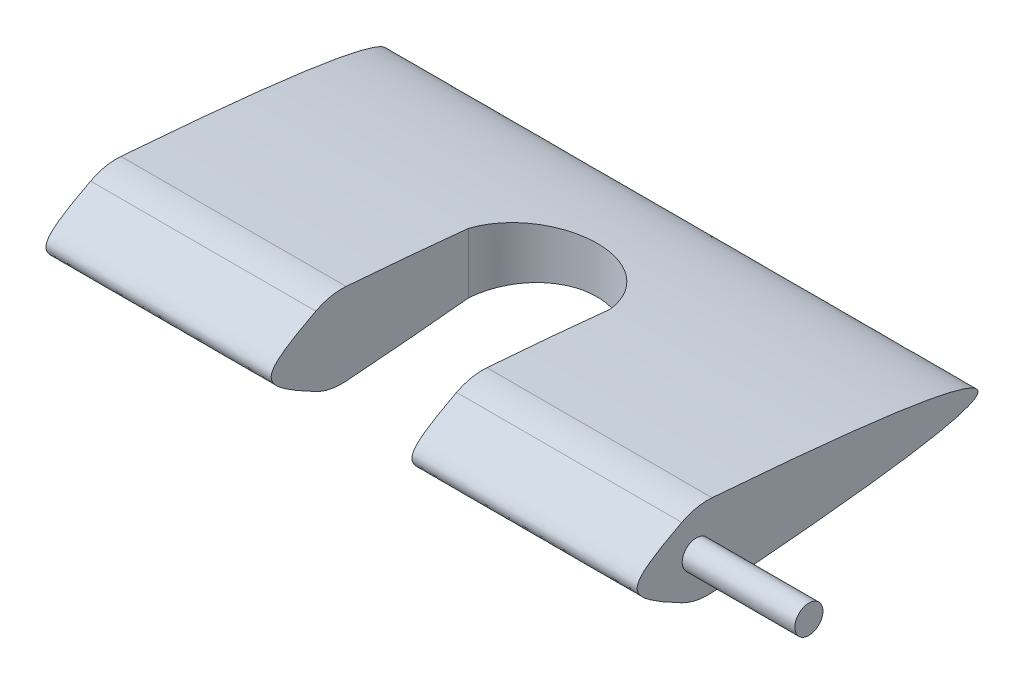
ISO-10303-21;
HEADER;
FILE_DESCRIPTION(('STEP AP214'),'2;1');
FILE_NAME('part.step','',(''),(''),'','','');
FILE_SCHEMA(('AUTOMOTIVE_DESIGN { 1 0 10303 214 1 1 1 1 }'));
ENDSEC;
DATA;
#1=APPLICATION_CONTEXT('core data for automotive mechanical design processes');
#2=APPLICATION_PROTOCOL_DEFINITION('international standard','automotive_design',2000,#1);
#3=PRODUCT_CONTEXT('',#1,'mechanical');
#4=PRODUCT('Part','Part','',(#3));
#5=PRODUCT_RELATED_PRODUCT_CATEGORY('part','',(#4));
#6=PRODUCT_DEFINITION_FORMATION('','',#4);
#7=PRODUCT_DEFINITION_CONTEXT('part definition',#1,'design');
#8=PRODUCT_DEFINITION('design','',#6,#7);
#9=PRODUCT_DEFINITION_SHAPE('','',#8);
#10=(LENGTH_UNIT() NAMED_UNIT(*) SI_UNIT(.MILLI.,.METRE.));
#11=(NAMED_UNIT(*) PLANE_ANGLE_UNIT() SI_UNIT($,.RADIAN.));
#12=(NAMED_UNIT(*) SI_UNIT($,.STERADIAN.) SOLID_ANGLE_UNIT());
#13=UNCERTAINTY_MEASURE_WITH_UNIT(LENGTH_MEASURE(1.E-05),#10,'distance_accuracy_value','');
#14=(GEOMETRIC_REPRESENTATION_CONTEXT(3) GLOBAL_UNCERTAINTY_ASSIGNED_CONTEXT((#13)) GLOBAL_UNIT_ASSIGNED_CONTEXT((#10,
#11,#12)) REPRESENTATION_CONTEXT('',''));
#15=CARTESIAN_POINT('',(0.,0.,0.));
#16=DIRECTION('',(0.,0.,1.));
#17=DIRECTION('',(1.,0.,0.));
#18=AXIS2_PLACEMENT_3D('',#15,#16,#17);
#19=CARTESIAN_POINT('',(0.,0.,0.));
#20=DIRECTION('',(1.,0.,0.));
#21=DIRECTION('',(0.,0.,-1.));
#22=AXIS2_PLACEMENT_3D('',#19,#20,#21);
#23=PLANE('',#22);
#24=CARTESIAN_POINT('',(0.,7.5,-3.7289748644447E-07));
#25=CARTESIAN_POINT('',(0.,0.,15.));
#26=CARTESIAN_POINT('',(0.,-7.5,3.72897486269191E-07));
#27=(BOUNDED_CURVE() B_SPLINE_CURVE(2,(#24,#25,#26),.UNSPECIFIED.,.F.,
.F.) B_SPLINE_CURVE_WITH_KNOTS((3,3),(0.,1.),
.UNSPECIFIED.) CURVE() GEOMETRIC_REPRESENTATION_ITEM() RATIONAL_B_SPLINE_CURVE((1.,
2.33333333333333,1.)) REPRESENTATION_ITEM(''));
#28=CARTESIAN_POINT('',(0.,6.18387436862828,2.58281473243405));
#29=VERTEX_POINT('',#28);
#30=CARTESIAN_POINT('',(0.,-6.18387425438638,2.58281556655406));
#31=VERTEX_POINT('',#30);
#32=EDGE_CURVE('E246',#29,#31,#27,.T.);
#33=ORIENTED_EDGE('',*,*,#32,.F.);
#34=CARTESIAN_POINT('',(0.,-2.68401655188481,-2.03892851247706));
#35=DIRECTION('',(1.,0.,0.));
#36=DIRECTION('',(0.,0.,-1.));
#37=AXIS2_PLACEMENT_3D('',#34,#35,#36);
#38=CIRCLE('',#37,10.);
#39=CARTESIAN_POINT('',(0.,7.28632207451857,-2.80856977621536));
#40=VERTEX_POINT('',#39);
#41=EDGE_CURVE('E474',#29,#40,#38,.F.);
#42=ORIENTED_EDGE('',*,*,#41,.T.);
#43=CARTESIAN_POINT('',(0.,7.5,-3.7289748644447E-07));
#44=CARTESIAN_POINT('',(0.,0.,-100.));
#45=CARTESIAN_POINT('',(0.,-7.5,3.72897486269191E-07));
#46=(BOUNDED_CURVE() B_SPLINE_CURVE(2,(#43,#44,#45),.UNSPECIFIED.,.F.,
.F.) B_SPLINE_CURVE_WITH_KNOTS((3,3),(0.,1.),
.UNSPECIFIED.) CURVE() GEOMETRIC_REPRESENTATION_ITEM() RATIONAL_B_SPLINE_CURVE((1.,
1.0014677651621,1.)) REPRESENTATION_ITEM(''));
#47=CARTESIAN_POINT('',(0.,-7.28632206754482,-2.80856914201004));
#48=VERTEX_POINT('',#47);
#49=EDGE_CURVE('E514',#40,#48,#46,.T.);
#50=ORIENTED_EDGE('',*,*,#49,.T.);
#51=CARTESIAN_POINT('',(0.,2.68401655925553,-2.03892788341429));
#52=DIRECTION('',(1.,0.,0.));
#53=DIRECTION('',(0.,0.,-1.));
#54=AXIS2_PLACEMENT_3D('',#51,#52,#53);
#55=CIRCLE('',#54,10.);
#56=EDGE_CURVE('E478',#48,#31,#55,.F.);
#57=ORIENTED_EDGE('',*,*,#56,.T.);
#58=EDGE_LOOP('',(#33,#42,#50,#57));
#59=FACE_BOUND('',#58,.T.);
#60=CARTESIAN_POINT('',(0.,2.22044604925031E-13,-13.7499999999998));
#61=DIRECTION('',(1.,0.,0.));
#62=DIRECTION('',(0.,0.,-1.));
#63=AXIS2_PLACEMENT_3D('',#60,#61,#62);
#64=CIRCLE('',#63,2.);
#65=CARTESIAN_POINT('',(0.,2.00000000000022,-13.7499999999998));
#66=VERTEX_POINT('',#65);
#67=CARTESIAN_POINT('',(0.,-1.99999999999978,-13.7499999999998));
#68=VERTEX_POINT('',#67);
#69=EDGE_CURVE('E68',#66,#68,#64,.F.);
#70=ORIENTED_EDGE('',*,*,#69,.F.);
#71=DIRECTION('',(0.,0.04540766091865,0.9989685402103));
#72=VECTOR('',#71,1.);
#73=CARTESIAN_POINT('',(0.,2.61958762886619,-0.119072164948463));
#74=LINE('',#73,#72);
#75=CARTESIAN_POINT('',(0.,2.49786390523226,-2.79699408489502));
#76=VERTEX_POINT('',#75);
#77=EDGE_CURVE('E12',#66,#76,#74,.T.);
#78=ORIENTED_EDGE('',*,*,#77,.T.);
#79=CARTESIAN_POINT('',(0.,2.22044604925031E-13,2.22044604925031E-13));
#80=DIRECTION('',(1.,0.,0.));
#81=DIRECTION('',(0.,0.,-1.));
#82=AXIS2_PLACEMENT_3D('',#79,#80,#81);
#83=CIRCLE('',#82,3.75);
#84=CARTESIAN_POINT('',(0.,-2.49786390523181,-2.79699408489502));
#85=VERTEX_POINT('',#84);
#86=EDGE_CURVE('E280',#85,#76,#83,.F.);
#87=ORIENTED_EDGE('',*,*,#86,.F.);
#88=DIRECTION('',(0.,-0.04540766091865,0.9989685402103));
#89=VECTOR('',#88,1.);
#90=CARTESIAN_POINT('',(0.,-2.61958762886575,-0.119072164948443));
#91=LINE('',#90,#89);
#92=EDGE_CURVE('E311',#68,#85,#91,.T.);
#93=ORIENTED_EDGE('',*,*,#92,.F.);
#94=EDGE_LOOP('',(#70,#78,#87,#93));
#95=FACE_BOUND('',#94,.T.);
#96=ADVANCED_FACE('F60',(#59,#95),#23,.F.);
#97=CARTESIAN_POINT('',(105.,7.5,-3.7289748644447E-07));
#98=CARTESIAN_POINT('',(105.,0.,-100.));
#99=CARTESIAN_POINT('',(105.,-7.5,3.72897486269191E-07));
#100=(BOUNDED_CURVE() B_SPLINE_CURVE(2,(#97,#98,#99),.UNSPECIFIED.,.F.,
.F.) B_SPLINE_CURVE_WITH_KNOTS((3,3),(0.,1.),
.UNSPECIFIED.) CURVE() GEOMETRIC_REPRESENTATION_ITEM() RATIONAL_B_SPLINE_CURVE((1.,
1.0014677651621,1.)) REPRESENTATION_ITEM(''));
#101=DIRECTION('',(-1.,0.,0.));
#102=VECTOR('',#101,1.);
#103=SURFACE_OF_LINEAR_EXTRUSION('',#100,#102);
#104=DIRECTION('',(-1.,0.,0.));
#105=VECTOR('',#104,1.);
#106=CARTESIAN_POINT('',(0.,7.28632207451857,-2.80856977621536));
#107=LINE('',#106,#105);
#108=CARTESIAN_POINT('',(40.,7.28632207451858,-2.80856977621536));
#109=VERTEX_POINT('',#108);
#110=EDGE_CURVE('E490',#40,#109,#107,.F.);
#111=ORIENTED_EDGE('',*,*,#110,.T.);
#112=CARTESIAN_POINT('',(40.,7.5,-3.7289748644447E-07));
#113=CARTESIAN_POINT('',(40.,0.,-100.));
#114=CARTESIAN_POINT('',(40.,-7.5,3.72897486269191E-07));
#115=(BOUNDED_CURVE() B_SPLINE_CURVE(2,(#112,#113,#114),.UNSPECIFIED.,.F.,
.F.) B_SPLINE_CURVE_WITH_KNOTS((3,3),(0.,1.),
.UNSPECIFIED.) CURVE() GEOMETRIC_REPRESENTATION_ITEM() RATIONAL_B_SPLINE_CURVE((1.,
1.0014677651621,1.)) REPRESENTATION_ITEM(''));
#116=CARTESIAN_POINT('',(40.,5.34878506985404,-24.5781791610746));
#117=VERTEX_POINT('',#116);
#118=EDGE_CURVE('E233',#109,#117,#115,.T.);
#119=ORIENTED_EDGE('',*,*,#118,.T.);
#120=CARTESIAN_POINT('',(40.,5.34878506985404,-24.5781791610746));
#121=CARTESIAN_POINT('',(40.0678801430756,5.31169119503989,-24.9311959440567));
#122=CARTESIAN_POINT('',(40.1507834210595,5.27450928435787,-25.2813077319358));
#123=CARTESIAN_POINT('',(40.3458846524781,5.20024551705142,-25.9732683528519));
#124=CARTESIAN_POINT('',(40.4580814593022,5.1631636565682,-26.3151175087337));
#125=CARTESIAN_POINT('',(40.7109561728681,5.08939283487344,-26.9879485508752));
#126=CARTESIAN_POINT('',(40.8516188667802,5.05270367477459,-27.3189361324685));
#127=CARTESIAN_POINT('',(41.1604647240169,4.97999378594866,-27.9678834618567));
#128=CARTESIAN_POINT('',(41.3286475184933,4.94397304827002,-28.2858433841881));
#129=CARTESIAN_POINT('',(41.6914585546635,4.87289069360894,-28.906636739573));
#130=CARTESIAN_POINT('',(41.8861004641603,4.83782958365442,-29.209462243441));
#131=CARTESIAN_POINT('',(42.3004028014392,4.76901077064709,-29.7976428727111));
#132=CARTESIAN_POINT('',(42.5200631447895,4.73525306319609,-30.0829980570666));
#133=CARTESIAN_POINT('',(42.9828164170752,4.66938475315652,-30.634125846401));
#134=CARTESIAN_POINT('',(43.2259041036361,4.63727378452722,-30.8999028090526));
#135=CARTESIAN_POINT('',(43.7338493222547,4.57503550283599,-31.4100204891335));
#136=CARTESIAN_POINT('',(43.9987067017558,4.54490817587584,-31.6543613567569));
#137=CARTESIAN_POINT('',(44.5476280869543,4.48705850278073,-32.1192334437331));
#138=CARTESIAN_POINT('',(44.8316413696267,4.45933021723105,-32.3398238150866));
#139=CARTESIAN_POINT('',(45.4174772793626,4.4065342711399,-32.7562940989182));
#140=CARTESIAN_POINT('',(45.7192999218937,4.38146661290925,-32.9521739899346));
#141=CARTESIAN_POINT('',(46.3386549043917,4.33431913842204,-33.3177983836322));
#142=CARTESIAN_POINT('',(46.6561891816002,4.31223969187134,-33.4875396527627));
#143=CARTESIAN_POINT('',(47.3046665049744,4.27138165455934,-33.7995900900865));
#144=CARTESIAN_POINT('',(47.6356094678933,4.25260304330896,-33.941899428557));
#145=CARTESIAN_POINT('',(48.3061043423443,4.21874666520556,-34.1970926627965));
#146=CARTESIAN_POINT('',(48.6455772303255,4.20364325576371,-34.3101808049648));
#147=CARTESIAN_POINT('',(49.3329727681321,4.17719447767935,-34.5074139628985));
#148=CARTESIAN_POINT('',(49.6808953799655,4.16584909214326,-34.5915591087724));
#149=CARTESIAN_POINT('',(50.3826567362234,4.14709721520578,-34.7302634003057));
#150=CARTESIAN_POINT('',(50.7364948690755,4.13969031919189,-34.7848255851201));
#151=CARTESIAN_POINT('',(51.4475697406401,4.12893429608891,-34.8639622238861));
#152=CARTESIAN_POINT('',(51.804806464705,4.12558515151914,-34.8885368070235));
#153=CARTESIAN_POINT('',(52.5175565886567,4.12300907507125,-34.9074441077101));
#154=CARTESIAN_POINT('',(52.8730642452712,4.1237530801485,-34.901990040803));
#155=CARTESIAN_POINT('',(53.5823454932412,4.12928373457918,-34.8613753424734));
#156=CARTESIAN_POINT('',(53.9361190937145,4.13407036265326,-34.8262148674179));
#157=CARTESIAN_POINT('',(54.6394192269773,4.14760866799747,-34.7264507226562));
#158=CARTESIAN_POINT('',(54.9889456793044,4.15636042026705,-34.6618464960278));
#159=CARTESIAN_POINT('',(55.6812638683352,4.17768964210423,-34.5036778972573));
#160=CARTESIAN_POINT('',(56.0240555960586,4.19026711677277,-34.4101134865016));
#161=CARTESIAN_POINT('',(56.7001736497202,4.21904029492765,-34.1948183773292));
#162=CARTESIAN_POINT('',(57.0335083309435,4.23523268485189,-34.0731134698848));
#163=CARTESIAN_POINT('',(57.6887030785651,4.27100229787543,-33.802386094651));
#164=CARTESIAN_POINT('',(58.0105631590982,4.290579516805,-33.6533636605136));
#165=CARTESIAN_POINT('',(58.6405506697767,4.33284124710942,-33.3290975281877));
#166=CARTESIAN_POINT('',(58.9486789852092,4.35552555778484,-33.1538555235582));
#167=CARTESIAN_POINT('',(59.549098791978,4.40369997639737,-32.7784073919167));
#168=CARTESIAN_POINT('',(59.8413902351216,4.42919009287205,-32.5782011889428));
#169=CARTESIAN_POINT('',(60.4098137756467,4.4828154174726,-32.1529968834003));
#170=CARTESIAN_POINT('',(60.6858398004738,4.51096541096192,-31.9278588402406));
#171=CARTESIAN_POINT('',(61.2179386540453,4.56944802725332,-31.4553786538623));
#172=CARTESIAN_POINT('',(61.4740112379204,4.59978067683224,-31.2080362382312));
#173=CARTESIAN_POINT('',(61.9645635420262,4.66230849316994,-30.6927801172791));
#174=CARTESIAN_POINT('',(62.1990326881943,4.69450455957967,-30.4248564546309));
#175=CARTESIAN_POINT('',(62.644626269206,4.76041348638287,-29.8704435243608));
#176=CARTESIAN_POINT('',(62.8557514376787,4.79412629906281,-29.5839548406293));
#177=CARTESIAN_POINT('',(63.2549003714923,4.86303653255641,-28.9919290829514));
#178=CARTESIAN_POINT('',(63.4427145994851,4.89824406556296,-28.6862519029525));
#179=CARTESIAN_POINT('',(63.7918442991666,4.96955676797845,-28.060220739217));
#180=CARTESIAN_POINT('',(63.9531598962021,5.00566193314038,-27.7398668249151));
#181=CARTESIAN_POINT('',(64.2479237233511,5.07840367210901,-27.0873106856622));
#182=CARTESIAN_POINT('',(64.3814180024938,5.11503925871381,-26.7551291221159));
#183=CARTESIAN_POINT('',(64.619897347441,5.18860017405163,-26.0808757302997));
#184=CARTESIAN_POINT('',(64.724898868413,5.22552532282322,-25.7388097373483));
#185=CARTESIAN_POINT('',(64.8505569817135,5.27685988103877,-25.2581948459556));
#186=CARTESIAN_POINT('',(64.8835919704051,5.29126355742293,-25.1227878890582));
#187=CARTESIAN_POINT('',(64.9451602845925,5.3200434159117,-24.8511288787441));
#188=CARTESIAN_POINT('',(64.9736991106537,5.33441961001858,-24.7148780732525));
#189=CARTESIAN_POINT('',(65.,5.34878506985404,-24.5781791610746));
#190=B_SPLINE_CURVE_WITH_KNOTS('',3,(#120,#121,#122,#123,#124,#125,#126,#127,#128,#129,#130,
#131,#132,#133,#134,#135,#136,#137,#138,#139,#140,#141,#142,#143,#144,#145,#146,#147,#148,#149,
#150,#151,#152,#153,#154,#155,#156,#157,#158,#159,#160,#161,#162,#163,#164,#165,#166,#167,#168,
#169,#170,#171,#172,#173,#174,#175,#176,#177,#178,#179,#180,#181,#182,#183,#184,#185,#186,#187,
#188,#189),.UNSPECIFIED.,.F.,.F.,(4,2,2,2,2,2,2,2,2,2,2,2,2,2,2,2,2,2,2,2,2,2,2,2,2,2,2,2,2,2,2,
2,2,2,4),(0.,1.08384787819964,2.16765333866133,3.25088111074634,4.33409436566854,
5.41786931009625,6.50164059712652,7.58516992752824,8.6686916654712,9.74944916365871,
10.830207600501,11.9110996283412,12.9919849465831,14.0650973450975,15.1382049195438,
16.2112022292156,17.2841949164301,18.3495787920757,19.4149570598406,20.4803554798394,
21.5457553203722,22.6101825576535,23.6746084836909,24.738965686612,25.803326128275,
26.8739965588466,27.9446801266508,29.0158849999744,30.0870561990548,31.1672488905739,
32.2474364722976,33.3258217052045,34.4035828160322,34.8238863952994,35.2436717176865),.UNSPECIFIED.);
#191=CARTESIAN_POINT('',(65.,5.34878506985404,-24.5781791610746));
#192=VERTEX_POINT('',#191);
#193=EDGE_CURVE('E273',#117,#192,#190,.T.);
#194=ORIENTED_EDGE('',*,*,#193,.T.);
#195=CARTESIAN_POINT('',(65.,7.5,-3.7289748644447E-07));
#196=CARTESIAN_POINT('',(65.,0.,-100.));
#197=CARTESIAN_POINT('',(65.,-7.5,3.72897486269191E-07));
#198=(BOUNDED_CURVE() B_SPLINE_CURVE(2,(#195,#196,#197),.UNSPECIFIED.,.F.,
.F.) B_SPLINE_CURVE_WITH_KNOTS((3,3),(0.,1.),
.UNSPECIFIED.) CURVE() GEOMETRIC_REPRESENTATION_ITEM() RATIONAL_B_SPLINE_CURVE((1.,
1.0014677651621,1.)) REPRESENTATION_ITEM(''));
#199=CARTESIAN_POINT('',(65.,7.28632207451858,-2.80856977621536));
#200=VERTEX_POINT('',#199);
#201=EDGE_CURVE('E215',#200,#192,#198,.T.);
#202=ORIENTED_EDGE('',*,*,#201,.F.);
#203=CARTESIAN_POINT('',(105.,7.28632207451857,-2.80856977621536));
#204=VERTEX_POINT('',#203);
#205=EDGE_CURVE('E489',#200,#204,#107,.F.);
#206=ORIENTED_EDGE('',*,*,#205,.T.);
#207=CARTESIAN_POINT('',(105.,-7.28632206754482,-2.80856914201004));
#208=VERTEX_POINT('',#207);
#209=EDGE_CURVE('E239',#204,#208,#100,.T.);
#210=ORIENTED_EDGE('',*,*,#209,.T.);
#211=DIRECTION('',(-1.,0.,0.));
#212=VECTOR('',#211,1.);
#213=CARTESIAN_POINT('',(105.,-7.28632206754482,-2.80856914201004));
#214=LINE('',#213,#212);
#215=CARTESIAN_POINT('',(65.,-7.28632206754482,-2.80856914201004));
#216=VERTEX_POINT('',#215);
#217=EDGE_CURVE('E486',#208,#216,#214,.T.);
#218=ORIENTED_EDGE('',*,*,#217,.T.);
#219=CARTESIAN_POINT('',(65.,-5.34878501395968,-24.5781791610746));
#220=VERTEX_POINT('',#219);
#221=EDGE_CURVE('E83',#220,#216,#198,.T.);
#222=ORIENTED_EDGE('',*,*,#221,.F.);
#223=CARTESIAN_POINT('',(65.,-5.34878501395968,-24.5781791610746));
#224=CARTESIAN_POINT('',(64.9321198569244,-5.31169113914612,-24.9311959440566));
#225=CARTESIAN_POINT('',(64.8492165789406,-5.27450922846467,-25.2813077319357));
#226=CARTESIAN_POINT('',(64.654115347522,-5.20024546115937,-25.9732683528517));
#227=CARTESIAN_POINT('',(64.5419185406978,-5.16316360067671,-26.3151175087335));
#228=CARTESIAN_POINT('',(64.289043827132,-5.08939277898306,-26.987948550875));
#229=CARTESIAN_POINT('',(64.1483811332199,-5.05270361888476,-27.3189361324682));
#230=CARTESIAN_POINT('',(63.8395352759834,-4.97999373005991,-27.9678834618563));
#231=CARTESIAN_POINT('',(63.6713524815069,-4.94397299238179,-28.2858433841877));
#232=CARTESIAN_POINT('',(63.3085414453369,-4.87289063772173,-28.9066367395725));
#233=CARTESIAN_POINT('',(63.1138995358401,-4.83782952776771,-29.2094622434405));
#234=CARTESIAN_POINT('',(62.6995971985613,-4.76901071476136,-29.7976428727104));
#235=CARTESIAN_POINT('',(62.4799368552111,-4.73525300731084,-30.0829980570659));
#236=CARTESIAN_POINT('',(62.0171835829254,-4.66938469727217,-30.6341258464003));
#237=CARTESIAN_POINT('',(61.7740958963646,-4.63727372864331,-30.8999028090518));
#238=CARTESIAN_POINT('',(61.2661506777461,-4.57503544695292,-31.4100204891327));
#239=CARTESIAN_POINT('',(61.0012932982452,-4.54490811999317,-31.6543613567561));
#240=CARTESIAN_POINT('',(60.4523719130467,-4.48705844689884,-32.1192334437323));
#241=CARTESIAN_POINT('',(60.1683586303744,-4.45933016134951,-32.3398238150858));
#242=CARTESIAN_POINT('',(59.5825227206386,-4.40653421525904,-32.7562940989174));
#243=CARTESIAN_POINT('',(59.2807000781076,-4.38146655702872,-32.9521739899339));
#244=CARTESIAN_POINT('',(58.6613450956097,-4.3343190825421,-33.3177983836315));
#245=CARTESIAN_POINT('',(58.3438108184012,-4.31223963599168,-33.487539652762));
#246=CARTESIAN_POINT('',(57.6953334950272,-4.27138159868019,-33.7995900900858));
#247=CARTESIAN_POINT('',(57.3643905321083,-4.25260298743003,-33.9418994285564));
#248=CARTESIAN_POINT('',(56.6938956576574,-4.21874660932704,-34.1970926627959));
#249=CARTESIAN_POINT('',(56.3544227696762,-4.20364319988537,-34.3101808049643));
#250=CARTESIAN_POINT('',(55.6670272318696,-4.17719442180133,-34.507413962898));
#251=CARTESIAN_POINT('',(55.3191046200362,-4.16584903626536,-34.591559108772));
#252=CARTESIAN_POINT('',(54.6173432637783,-4.14709715932809,-34.7302634003054));
#253=CARTESIAN_POINT('',(54.2635051309262,-4.13969026331429,-34.7848255851199));
#254=CARTESIAN_POINT('',(53.5524302593615,-4.12893424021142,-34.863962223886));
#255=CARTESIAN_POINT('',(53.1951935352966,-4.12558509564169,-34.8885368070234));
#256=CARTESIAN_POINT('',(52.4824434113448,-4.12300901919382,-34.9074441077101));
#257=CARTESIAN_POINT('',(52.1269357547303,-4.12375302427105,-34.9019900408031));
#258=CARTESIAN_POINT('',(51.4176545067601,-4.12928367870166,-34.8613753424735));
#259=CARTESIAN_POINT('',(51.0638809062868,-4.13407030677567,-34.826214867418));
#260=CARTESIAN_POINT('',(50.3605807730239,-4.14760861211972,-34.7264507226564));
#261=CARTESIAN_POINT('',(50.0110543206967,-4.15636036438919,-34.661846496028));
#262=CARTESIAN_POINT('',(49.3187361316658,-4.1776895862261,-34.5036778972575));
#263=CARTESIAN_POINT('',(48.9759444039423,-4.19026706089449,-34.4101134865019));
#264=CARTESIAN_POINT('',(48.2998263502805,-4.21904023904901,-34.1948183773295));
#265=CARTESIAN_POINT('',(47.9664916690571,-4.23523262897306,-34.0731134698851));
#266=CARTESIAN_POINT('',(47.3112969214353,-4.27100224199616,-33.8023860946512));
#267=CARTESIAN_POINT('',(46.9894368409022,-4.29057946092549,-33.6533636605138));
#268=CARTESIAN_POINT('',(46.3594493302235,-4.33284119122939,-33.3290975281878));
#269=CARTESIAN_POINT('',(46.051321014791,-4.35552550190452,-33.1538555235583));
#270=CARTESIAN_POINT('',(45.450901208022,-4.40369992051645,-32.7784073919167));
#271=CARTESIAN_POINT('',(45.1586097648784,-4.42919003699082,-32.5782011889428));
#272=CARTESIAN_POINT('',(44.5901862243531,-4.48281536159068,-32.1529968834001));
#273=CARTESIAN_POINT('',(44.314160199526,-4.51096535507962,-31.9278588402404));
#274=CARTESIAN_POINT('',(43.7820613459544,-4.56944797137026,-31.4553786538621));
#275=CARTESIAN_POINT('',(43.5259887620793,-4.59978062094879,-31.2080362382308));
#276=CARTESIAN_POINT('',(43.0354364579735,-4.66230843728566,-30.6927801172787));
#277=CARTESIAN_POINT('',(42.8009673118052,-4.69450450369495,-30.4248564546304));
#278=CARTESIAN_POINT('',(42.3553737307935,-4.76041343049726,-29.8704435243602));
#279=CARTESIAN_POINT('',(42.1442485623208,-4.79412624317675,-29.5839548406286));
#280=CARTESIAN_POINT('',(41.7450996285072,-4.86303647666938,-28.9919290829506));
#281=CARTESIAN_POINT('',(41.5572854005144,-4.89824400967543,-28.6862519029516));
#282=CARTESIAN_POINT('',(41.208155700833,-4.9695567120899,-28.0602207392162));
#283=CARTESIAN_POINT('',(41.0468401037975,-5.0056618772513,-27.7398668249143));
#284=CARTESIAN_POINT('',(40.7520762766485,-5.07840361621887,-27.0873106856613));
#285=CARTESIAN_POINT('',(40.6185819975059,-5.11503920282312,-26.755129122115));
#286=CARTESIAN_POINT('',(40.3801026525587,-5.18860011815984,-26.0808757302987));
#287=CARTESIAN_POINT('',(40.2751011315868,-5.22552526693087,-25.7388097373474));
#288=CARTESIAN_POINT('',(40.1494430182864,-5.27685982514562,-25.2581948459548));
#289=CARTESIAN_POINT('',(40.1164080295948,-5.29126350152954,-25.1227878890575));
#290=CARTESIAN_POINT('',(40.0548397154074,-5.32004336001783,-24.8511288787438));
#291=CARTESIAN_POINT('',(40.0263008893463,-5.33441955412447,-24.7148780732524));
#292=CARTESIAN_POINT('',(40.,-5.34878501395968,-24.5781791610746));
#293=B_SPLINE_CURVE_WITH_KNOTS('',3,(#223,#224,#225,#226,#227,#228,#229,#230,#231,#232,#233,
#234,#235,#236,#237,#238,#239,#240,#241,#242,#243,#244,#245,#246,#247,#248,#249,#250,#251,#252,
#253,#254,#255,#256,#257,#258,#259,#260,#261,#262,#263,#264,#265,#266,#267,#268,#269,#270,#271,
#272,#273,#274,#275,#276,#277,#278,#279,#280,#281,#282,#283,#284,#285,#286,#287,#288,#289,#290,
#291,#292),.UNSPECIFIED.,.F.,.F.,(4,2,2,2,2,2,2,2,2,2,2,2,2,2,2,2,2,2,2,2,2,2,2,2,2,2,2,2,2,2,2,
2,2,2,4),(0.,1.08384787819934,2.16765333866073,3.25088111074544,4.33409436566734,
5.41786931009474,6.5016405971247,7.58516992752611,8.66869166546876,9.74944916365609,
10.8302076004982,11.9110996283382,12.9919849465799,14.0650973450944,15.1382049195406,
16.2112022292125,17.284194916427,18.3495787920728,19.4149570598379,20.480355479837,
21.54575532037,22.6101825576515,23.674608483689,24.7389656866104,25.8033261282736,
26.8739965588452,27.9446801266495,29.0158849999731,30.0870561990537,31.1672488905726,
32.2474364722962,33.3258217052029,34.4035828160305,34.8238863952971,35.2436717176836),.UNSPECIFIED.);
#294=CARTESIAN_POINT('',(40.,-5.34878501395968,-24.5781791610746));
#295=VERTEX_POINT('',#294);
#296=EDGE_CURVE('E265',#220,#295,#293,.T.);
#297=ORIENTED_EDGE('',*,*,#296,.T.);
#298=CARTESIAN_POINT('',(40.,-7.28632206754482,-2.80856914201004));
#299=VERTEX_POINT('',#298);
#300=EDGE_CURVE('E224',#295,#299,#115,.T.);
#301=ORIENTED_EDGE('',*,*,#300,.T.);
#302=EDGE_CURVE('E485',#299,#48,#214,.T.);
#303=ORIENTED_EDGE('',*,*,#302,.T.);
#304=ORIENTED_EDGE('',*,*,#49,.F.);
#305=EDGE_LOOP('',(#111,#119,#194,#202,#206,#210,#218,#222,#297,#301,#303,#304));
#306=FACE_BOUND('',#305,.T.);
#307=ADVANCED_FACE('F255',(#306),#103,.T.);
#308=CARTESIAN_POINT('',(105.,7.5,-3.7289748644447E-07));
#309=CARTESIAN_POINT('',(105.,0.,15.));
#310=CARTESIAN_POINT('',(105.,-7.5,3.72897486269191E-07));
#311=(BOUNDED_CURVE() B_SPLINE_CURVE(2,(#308,#309,#310),.UNSPECIFIED.,.F.,
.F.) B_SPLINE_CURVE_WITH_KNOTS((3,3),(0.,1.),
.UNSPECIFIED.) CURVE() GEOMETRIC_REPRESENTATION_ITEM() RATIONAL_B_SPLINE_CURVE((1.,
2.33333333333333,1.)) REPRESENTATION_ITEM(''));
#312=DIRECTION('',(-1.,0.,0.));
#313=VECTOR('',#312,1.);
#314=SURFACE_OF_LINEAR_EXTRUSION('',#311,#313);
#315=CARTESIAN_POINT('',(40.,7.5,-3.7289748644447E-07));
#316=CARTESIAN_POINT('',(40.,0.,15.));
#317=CARTESIAN_POINT('',(40.,-7.5,3.72897486269191E-07));
#318=(BOUNDED_CURVE() B_SPLINE_CURVE(2,(#315,#316,#317),.UNSPECIFIED.,.F.,
.F.) B_SPLINE_CURVE_WITH_KNOTS((3,3),(0.,1.),
.UNSPECIFIED.) CURVE() GEOMETRIC_REPRESENTATION_ITEM() RATIONAL_B_SPLINE_CURVE((1.,
2.33333333333333,1.)) REPRESENTATION_ITEM(''));
#319=CARTESIAN_POINT('',(40.,6.18387436862829,2.58281473243403));
#320=VERTEX_POINT('',#319);
#321=CARTESIAN_POINT('',(40.,-6.18387425438638,2.58281556655406));
#322=VERTEX_POINT('',#321);
#323=EDGE_CURVE('E220',#320,#322,#318,.T.);
#324=ORIENTED_EDGE('',*,*,#323,.F.);
#325=DIRECTION('',(-1.,0.,0.));
#326=VECTOR('',#325,1.);
#327=CARTESIAN_POINT('',(105.,6.18387436862828,2.58281473243406));
#328=LINE('',#327,#326);
#329=EDGE_CURVE('E467',#320,#29,#328,.T.);
#330=ORIENTED_EDGE('',*,*,#329,.T.);
#331=ORIENTED_EDGE('',*,*,#32,.T.);
#332=DIRECTION('',(-1.,0.,0.));
#333=VECTOR('',#332,1.);
#334=CARTESIAN_POINT('',(0.,-6.18387425438637,2.58281556655408));
#335=LINE('',#334,#333);
#336=EDGE_CURVE('E470',#31,#322,#335,.F.);
#337=ORIENTED_EDGE('',*,*,#336,.T.);
#338=EDGE_LOOP('',(#324,#330,#331,#337));
#339=FACE_BOUND('',#338,.T.);
#340=ADVANCED_FACE('F259',(#339),#314,.F.);
#341=CARTESIAN_POINT('',(105.,6.18387436862828,2.58281473243405));
#342=VERTEX_POINT('',#341);
#343=CARTESIAN_POINT('',(65.,6.18387436862829,2.58281473243403));
#344=VERTEX_POINT('',#343);
#345=EDGE_CURVE('E475',#342,#344,#328,.T.);
#346=ORIENTED_EDGE('',*,*,#345,.T.);
#347=CARTESIAN_POINT('',(65.,7.5,-3.7289748644447E-07));
#348=CARTESIAN_POINT('',(65.,0.,15.));
#349=CARTESIAN_POINT('',(65.,-7.5,3.72897486269191E-07));
#350=(BOUNDED_CURVE() B_SPLINE_CURVE(2,(#347,#348,#349),.UNSPECIFIED.,.F.,
.F.) B_SPLINE_CURVE_WITH_KNOTS((3,3),(0.,1.),
.UNSPECIFIED.) CURVE() GEOMETRIC_REPRESENTATION_ITEM() RATIONAL_B_SPLINE_CURVE((1.,
2.33333333333333,1.)) REPRESENTATION_ITEM(''));
#351=CARTESIAN_POINT('',(65.,-6.18387425438638,2.58281556655406));
#352=VERTEX_POINT('',#351);
#353=EDGE_CURVE('E202',#344,#352,#350,.T.);
#354=ORIENTED_EDGE('',*,*,#353,.T.);
#355=CARTESIAN_POINT('',(105.,-6.18387425438638,2.58281556655406));
#356=VERTEX_POINT('',#355);
#357=EDGE_CURVE('E479',#352,#356,#335,.F.);
#358=ORIENTED_EDGE('',*,*,#357,.T.);
#359=EDGE_CURVE('E245',#342,#356,#311,.T.);
#360=ORIENTED_EDGE('',*,*,#359,.F.);
#361=EDGE_LOOP('',(#346,#354,#358,#360));
#362=FACE_BOUND('',#361,.T.);
#363=ADVANCED_FACE('F426',(#362),#314,.F.);
#364=CARTESIAN_POINT('',(52.5,-2.68401655188481,-2.03892851247706));
#365=DIRECTION('',(-1.,0.,0.));
#366=DIRECTION('',(0.,0.,1.));
#367=AXIS2_PLACEMENT_3D('',#364,#365,#366);
#368=CYLINDRICAL_SURFACE('',#367,10.);
#369=ORIENTED_EDGE('',*,*,#329,.F.);
#370=CARTESIAN_POINT('',(40.,-2.68401655188481,-2.03892851247706));
#371=DIRECTION('',(1.,0.,0.));
#372=DIRECTION('',(0.,0.,-1.));
#373=AXIS2_PLACEMENT_3D('',#370,#371,#372);
#374=CIRCLE('',#373,10.);
#375=EDGE_CURVE('E232',#320,#109,#374,.F.);
#376=ORIENTED_EDGE('',*,*,#375,.T.);
#377=ORIENTED_EDGE('',*,*,#110,.F.);
#378=ORIENTED_EDGE('',*,*,#41,.F.);
#379=EDGE_LOOP('',(#369,#376,#377,#378));
#380=FACE_BOUND('',#379,.T.);
#381=ADVANCED_FACE('F262',(#380),#368,.T.);
#382=CARTESIAN_POINT('',(65.,-2.68401655188481,-2.03892851247706));
#383=DIRECTION('',(1.,0.,0.));
#384=DIRECTION('',(0.,0.,-1.));
#385=AXIS2_PLACEMENT_3D('',#382,#383,#384);
#386=CIRCLE('',#385,10.);
#387=EDGE_CURVE('E214',#344,#200,#386,.F.);
#388=ORIENTED_EDGE('',*,*,#387,.F.);
#389=ORIENTED_EDGE('',*,*,#345,.F.);
#390=CARTESIAN_POINT('',(105.,-2.68401655188481,-2.03892851247706));
#391=DIRECTION('',(1.,0.,0.));
#392=DIRECTION('',(0.,0.,-1.));
#393=AXIS2_PLACEMENT_3D('',#390,#391,#392);
#394=CIRCLE('',#393,10.);
#395=EDGE_CURVE('E494',#204,#342,#394,.T.);
#396=ORIENTED_EDGE('',*,*,#395,.F.);
#397=ORIENTED_EDGE('',*,*,#205,.F.);
#398=EDGE_LOOP('',(#388,#389,#396,#397));
#399=FACE_BOUND('',#398,.T.);
#400=ADVANCED_FACE('F413',(#399),#368,.T.);
#401=CARTESIAN_POINT('',(52.5,2.68401655925553,-2.03892788341429));
#402=DIRECTION('',(-1.,0.,0.));
#403=DIRECTION('',(0.,0.,1.));
#404=AXIS2_PLACEMENT_3D('',#401,#402,#403);
#405=CYLINDRICAL_SURFACE('',#404,10.);
#406=CARTESIAN_POINT('',(40.,2.68401655925553,-2.03892788341429));
#407=DIRECTION('',(1.,0.,0.));
#408=DIRECTION('',(0.,0.,-1.));
#409=AXIS2_PLACEMENT_3D('',#406,#407,#408);
#410=CIRCLE('',#409,10.);
#411=EDGE_CURVE('E497',#299,#322,#410,.F.);
#412=ORIENTED_EDGE('',*,*,#411,.T.);
#413=ORIENTED_EDGE('',*,*,#336,.F.);
#414=ORIENTED_EDGE('',*,*,#56,.F.);
#415=ORIENTED_EDGE('',*,*,#302,.F.);
#416=EDGE_LOOP('',(#412,#413,#414,#415));
#417=FACE_BOUND('',#416,.T.);
#418=ADVANCED_FACE('F62',(#417),#405,.T.);
#419=ORIENTED_EDGE('',*,*,#357,.F.);
#420=CARTESIAN_POINT('',(65.,2.68401655925553,-2.03892788341429));
#421=DIRECTION('',(1.,0.,0.));
#422=DIRECTION('',(0.,0.,-1.));
#423=AXIS2_PLACEMENT_3D('',#420,#421,#422);
#424=CIRCLE('',#423,10.);
#425=EDGE_CURVE('E496',#216,#352,#424,.F.);
#426=ORIENTED_EDGE('',*,*,#425,.F.);
#427=ORIENTED_EDGE('',*,*,#217,.F.);
#428=CARTESIAN_POINT('',(105.,2.68401655925553,-2.03892788341429));
#429=DIRECTION('',(1.,0.,0.));
#430=DIRECTION('',(0.,0.,-1.));
#431=AXIS2_PLACEMENT_3D('',#428,#429,#430);
#432=CIRCLE('',#431,10.);
#433=EDGE_CURVE('E492',#356,#208,#432,.T.);
#434=ORIENTED_EDGE('',*,*,#433,.F.);
#435=EDGE_LOOP('',(#419,#426,#427,#434));
#436=FACE_BOUND('',#435,.T.);
#437=ADVANCED_FACE('F299',(#436),#405,.T.);
#438=CARTESIAN_POINT('',(105.,0.,0.));
#439=DIRECTION('',(1.,0.,0.));
#440=DIRECTION('',(0.,0.,-1.));
#441=AXIS2_PLACEMENT_3D('',#438,#439,#440);
#442=PLANE('',#441);
#443=CARTESIAN_POINT('',(105.,0.,0.));
#444=DIRECTION('',(1.,0.,0.));
#445=DIRECTION('',(0.,0.,-1.));
#446=AXIS2_PLACEMENT_3D('',#443,#444,#445);
#447=CIRCLE('',#446,2.5);
#448=CARTESIAN_POINT('',(105.,0.,-2.5));
#449=VERTEX_POINT('',#448);
#450=EDGE_CURVE('E189',#449,#449,#447,.T.);
#451=ORIENTED_EDGE('',*,*,#450,.F.);
#452=EDGE_LOOP('',(#451));
#453=FACE_BOUND('',#452,.T.);
#454=ORIENTED_EDGE('',*,*,#209,.F.);
#455=ORIENTED_EDGE('',*,*,#395,.T.);
#456=ORIENTED_EDGE('',*,*,#359,.T.);
#457=ORIENTED_EDGE('',*,*,#433,.T.);
#458=EDGE_LOOP('',(#454,#455,#456,#457));
#459=FACE_BOUND('',#458,.T.);
#460=ADVANCED_FACE('F296',(#453,#459),#442,.T.);
#461=CARTESIAN_POINT('',(40.,-7.31598344074447,0.));
#462=DIRECTION('',(1.,0.,0.));
#463=DIRECTION('',(0.,0.,-1.));
#464=AXIS2_PLACEMENT_3D('',#461,#462,#463);
#465=PLANE('',#464);
#466=ORIENTED_EDGE('',*,*,#375,.F.);
#467=ORIENTED_EDGE('',*,*,#323,.T.);
#468=ORIENTED_EDGE('',*,*,#411,.F.);
#469=ORIENTED_EDGE('',*,*,#300,.F.);
#470=DIRECTION('',(0.,1.,0.));
#471=VECTOR('',#470,1.);
#472=CARTESIAN_POINT('',(40.,-7.31598344074447,-24.5781791610746));
#473=LINE('',#472,#471);
#474=EDGE_CURVE('E199',#295,#117,#473,.T.);
#475=ORIENTED_EDGE('',*,*,#474,.T.);
#476=ORIENTED_EDGE('',*,*,#118,.F.);
#477=EDGE_LOOP('',(#466,#467,#468,#469,#475,#476));
#478=FACE_BOUND('',#477,.T.);
#479=ADVANCED_FACE('F293',(#478),#465,.T.);
#480=CARTESIAN_POINT('',(65.,-7.31598344074447,0.));
#481=DIRECTION('',(1.,0.,0.));
#482=DIRECTION('',(0.,0.,-1.));
#483=AXIS2_PLACEMENT_3D('',#480,#481,#482);
#484=PLANE('',#483);
#485=ORIENTED_EDGE('',*,*,#201,.T.);
#486=DIRECTION('',(0.,1.,0.));
#487=VECTOR('',#486,1.);
#488=CARTESIAN_POINT('',(65.,-7.31598344074447,-24.5781791610746));
#489=LINE('',#488,#487);
#490=EDGE_CURVE('E171',#220,#192,#489,.T.);
#491=ORIENTED_EDGE('',*,*,#490,.F.);
#492=ORIENTED_EDGE('',*,*,#221,.T.);
#493=ORIENTED_EDGE('',*,*,#425,.T.);
#494=ORIENTED_EDGE('',*,*,#353,.F.);
#495=ORIENTED_EDGE('',*,*,#387,.T.);
#496=EDGE_LOOP('',(#485,#491,#492,#493,#494,#495));
#497=FACE_BOUND('',#496,.T.);
#498=ADVANCED_FACE('F287',(#497),#484,.F.);
#499=CARTESIAN_POINT('',(52.5,-7.31598344074447,-22.173256385442));
#500=DIRECTION('',(0.,1.,0.));
#501=DIRECTION('',(0.,0.,1.));
#502=AXIS2_PLACEMENT_3D('',#499,#500,#501);
#503=CYLINDRICAL_SURFACE('',#502,12.729244029272);
#504=ORIENTED_EDGE('',*,*,#474,.F.);
#505=ORIENTED_EDGE('',*,*,#296,.F.);
#506=ORIENTED_EDGE('',*,*,#490,.T.);
#507=ORIENTED_EDGE('',*,*,#193,.F.);
#508=EDGE_LOOP('',(#504,#505,#506,#507));
#509=FACE_BOUND('',#508,.T.);
#510=ADVANCED_FACE('F282',(#509),#503,.F.);
#511=CARTESIAN_POINT('',(-0.999999999999997,2.6195876288662,-0.119072164948232));
#512=DIRECTION('',(0.,0.998968540210299,-0.04540766091865));
#513=DIRECTION('',(0.,-0.04540766091865,-0.9989685402103));
#514=AXIS2_PLACEMENT_3D('',#511,#512,#513);
#515=PLANE('',#514);
#516=DIRECTION('',(1.,0.,0.));
#517=VECTOR('',#516,1.);
#518=CARTESIAN_POINT('',(-0.999999999999997,2.00000000000022,-13.7499999999998));
#519=LINE('',#518,#517);
#520=CARTESIAN_POINT('',(3.,2.00000000000022,-13.7499999999998));
#521=VERTEX_POINT('',#520);
#522=EDGE_CURVE('E163',#66,#521,#519,.T.);
#523=ORIENTED_EDGE('',*,*,#522,.T.);
#524=DIRECTION('',(0.,0.04540766091865,0.998968540210299));
#525=VECTOR('',#524,1.);
#526=CARTESIAN_POINT('',(3.,2.6195876288662,-0.119072164948232));
#527=LINE('',#526,#525);
#528=CARTESIAN_POINT('',(3.,2.49786390523226,-2.79699408489502));
#529=VERTEX_POINT('',#528);
#530=EDGE_CURVE('E168',#521,#529,#527,.T.);
#531=ORIENTED_EDGE('',*,*,#530,.T.);
#532=DIRECTION('',(1.,0.,0.));
#533=VECTOR('',#532,1.);
#534=CARTESIAN_POINT('',(-0.999999999999997,2.49786390523226,-2.79699408489502));
#535=LINE('',#534,#533);
#536=EDGE_CURVE('E195',#76,#529,#535,.T.);
#537=ORIENTED_EDGE('',*,*,#536,.F.);
#538=ORIENTED_EDGE('',*,*,#77,.F.);
#539=EDGE_LOOP('',(#523,#531,#537,#538));
#540=FACE_BOUND('',#539,.T.);
#541=ADVANCED_FACE('F165',(#540),#515,.F.);
#542=CARTESIAN_POINT('',(-0.999999999999997,2.22044604925031E-13,-13.7499999999998));
#543=DIRECTION('',(1.,0.,0.));
#544=DIRECTION('',(0.,0.,-1.));
#545=AXIS2_PLACEMENT_3D('',#542,#543,#544);
#546=CYLINDRICAL_SURFACE('',#545,2.);
#547=ORIENTED_EDGE('',*,*,#69,.T.);
#548=DIRECTION('',(1.,0.,0.));
#549=VECTOR('',#548,1.);
#550=CARTESIAN_POINT('',(-0.999999999999997,-1.99999999999978,-13.7499999999998));
#551=LINE('',#550,#549);
#552=CARTESIAN_POINT('',(3.,-1.99999999999978,-13.7499999999998));
#553=VERTEX_POINT('',#552);
#554=EDGE_CURVE('E172',#68,#553,#551,.T.);
#555=ORIENTED_EDGE('',*,*,#554,.T.);
#556=CARTESIAN_POINT('',(3.,2.22044604925031E-13,-13.7499999999998));
#557=DIRECTION('',(-1.,0.,0.));
#558=DIRECTION('',(0.,0.,1.));
#559=AXIS2_PLACEMENT_3D('',#556,#557,#558);
#560=CIRCLE('',#559,2.);
#561=EDGE_CURVE('E175',#521,#553,#560,.T.);
#562=ORIENTED_EDGE('',*,*,#561,.F.);
#563=ORIENTED_EDGE('',*,*,#522,.F.);
#564=EDGE_LOOP('',(#547,#555,#562,#563));
#565=FACE_BOUND('',#564,.T.);
#566=ADVANCED_FACE('F176',(#565),#546,.F.);
#567=CARTESIAN_POINT('',(-0.999999999999997,-2.61958762886576,-0.119072164948232));
#568=DIRECTION('',(0.,0.998968540210299,0.04540766091865));
#569=DIRECTION('',(0.,0.04540766091865,-0.9989685402103));
#570=AXIS2_PLACEMENT_3D('',#567,#568,#569);
#571=PLANE('',#570);
#572=ORIENTED_EDGE('',*,*,#92,.T.);
#573=DIRECTION('',(1.,0.,0.));
#574=VECTOR('',#573,1.);
#575=CARTESIAN_POINT('',(-0.999999999999997,-2.49786390523181,-2.79699408489502));
#576=LINE('',#575,#574);
#577=CARTESIAN_POINT('',(3.,-2.49786390523181,-2.79699408489502));
#578=VERTEX_POINT('',#577);
#579=EDGE_CURVE('E75',#85,#578,#576,.T.);
#580=ORIENTED_EDGE('',*,*,#579,.T.);
#581=DIRECTION('',(0.,-0.04540766091865,0.998968540210299));
#582=VECTOR('',#581,1.);
#583=CARTESIAN_POINT('',(3.,-2.61958762886576,-0.119072164948232));
#584=LINE('',#583,#582);
#585=EDGE_CURVE('E181',#553,#578,#584,.T.);
#586=ORIENTED_EDGE('',*,*,#585,.F.);
#587=ORIENTED_EDGE('',*,*,#554,.F.);
#588=EDGE_LOOP('',(#572,#580,#586,#587));
#589=FACE_BOUND('',#588,.T.);
#590=ADVANCED_FACE('F315',(#589),#571,.T.);
#591=CARTESIAN_POINT('',(-0.999999999999997,2.22044604925031E-13,2.22044604925031E-13));
#592=DIRECTION('',(1.,0.,0.));
#593=DIRECTION('',(0.,0.,-1.));
#594=AXIS2_PLACEMENT_3D('',#591,#592,#593);
#595=CYLINDRICAL_SURFACE('',#594,3.75);
#596=ORIENTED_EDGE('',*,*,#86,.T.);
#597=ORIENTED_EDGE('',*,*,#536,.T.);
#598=CARTESIAN_POINT('',(3.,2.22044604925031E-13,2.22044604925031E-13));
#599=DIRECTION('',(-1.,0.,0.));
#600=DIRECTION('',(0.,0.,1.));
#601=AXIS2_PLACEMENT_3D('',#598,#599,#600);
#602=CIRCLE('',#601,3.75);
#603=EDGE_CURVE('E185',#578,#529,#602,.T.);
#604=ORIENTED_EDGE('',*,*,#603,.F.);
#605=ORIENTED_EDGE('',*,*,#579,.F.);
#606=EDGE_LOOP('',(#596,#597,#604,#605));
#607=FACE_BOUND('',#606,.T.);
#608=ADVANCED_FACE('F313',(#607),#595,.F.);
#609=CARTESIAN_POINT('',(3.,2.22044604925031E-13,2.22044604925031E-13));
#610=DIRECTION('',(-1.,0.,0.));
#611=DIRECTION('',(0.,0.,1.));
#612=AXIS2_PLACEMENT_3D('',#609,#610,#611);
#613=PLANE('',#612);
#614=ORIENTED_EDGE('',*,*,#530,.F.);
#615=ORIENTED_EDGE('',*,*,#561,.T.);
#616=ORIENTED_EDGE('',*,*,#585,.T.);
#617=ORIENTED_EDGE('',*,*,#603,.T.);
#618=EDGE_LOOP('',(#614,#615,#616,#617));
#619=FACE_BOUND('',#618,.T.);
#620=ADVANCED_FACE('F184',(#619),#613,.T.);
#621=CARTESIAN_POINT('',(125.,0.,0.));
#622=DIRECTION('',(-1.,0.,0.));
#623=DIRECTION('',(0.,0.,1.));
#624=AXIS2_PLACEMENT_3D('',#621,#622,#623);
#625=CYLINDRICAL_SURFACE('',#624,2.5);
#626=CARTESIAN_POINT('',(125.,0.,0.));
#627=DIRECTION('',(1.,0.,0.));
#628=DIRECTION('',(0.,0.,-1.));
#629=AXIS2_PLACEMENT_3D('',#626,#627,#628);
#630=CIRCLE('',#629,2.5);
#631=CARTESIAN_POINT('',(125.,0.,-2.5));
#632=VERTEX_POINT('',#631);
#633=EDGE_CURVE('E186',#632,#632,#630,.T.);
#634=ORIENTED_EDGE('',*,*,#633,.F.);
#635=EDGE_LOOP('',(#634));
#636=FACE_BOUND('',#635,.T.);
#637=ORIENTED_EDGE('',*,*,#450,.T.);
#638=EDGE_LOOP('',(#637));
#639=FACE_BOUND('',#638,.T.);
#640=ADVANCED_FACE('F321',(#636,#639),#625,.T.);
#641=CARTESIAN_POINT('',(125.,0.,0.));
#642=DIRECTION('',(1.,0.,0.));
#643=DIRECTION('',(0.,0.,-1.));
#644=AXIS2_PLACEMENT_3D('',#641,#642,#643);
#645=PLANE('',#644);
#646=ORIENTED_EDGE('',*,*,#633,.T.);
#647=EDGE_LOOP('',(#646));
#648=FACE_BOUND('',#647,.T.);
#649=ADVANCED_FACE('F368',(#648),#645,.T.);
#650=CLOSED_SHELL('',(#96,#307,#340,#363,#381,#400,#418,#437,#460,#479,#498,#510,#541,#566,#590,
#608,#620,#640,#649));
#651=MANIFOLD_SOLID_BREP('B2',#650);
#652=ADVANCED_BREP_SHAPE_REPRESENTATION('',(#18,#651),#14);
#653=SHAPE_DEFINITION_REPRESENTATION(#9,#652);
ENDSEC;
END-ISO-10303-21;
